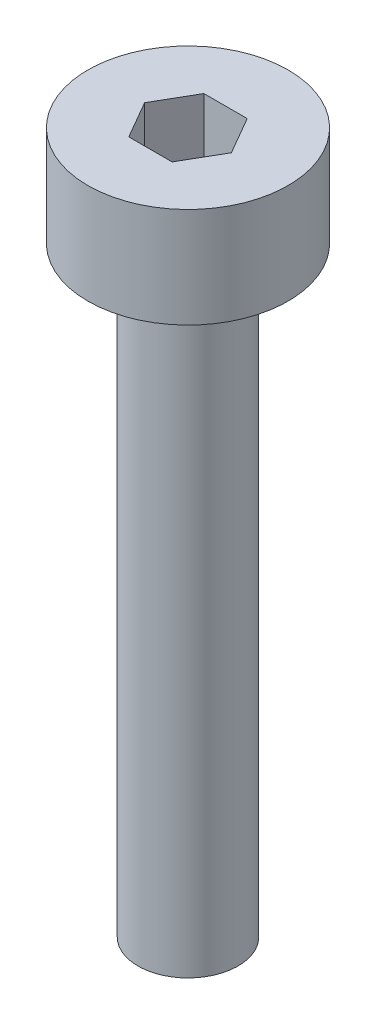
ISO-10303-21;
HEADER;
FILE_DESCRIPTION(('STEP AP214'),'2;1');
FILE_NAME('part.step','',(''),(''),'','','');
FILE_SCHEMA(('AUTOMOTIVE_DESIGN { 1 0 10303 214 1 1 1 1 }'));
ENDSEC;
DATA;
#1=APPLICATION_CONTEXT('core data for automotive mechanical design processes');
#2=APPLICATION_PROTOCOL_DEFINITION('international standard','automotive_design',2000,#1);
#3=PRODUCT_CONTEXT('',#1,'mechanical');
#4=PRODUCT('Part','Part','',(#3));
#5=PRODUCT_RELATED_PRODUCT_CATEGORY('part','',(#4));
#6=PRODUCT_DEFINITION_FORMATION('','',#4);
#7=PRODUCT_DEFINITION_CONTEXT('part definition',#1,'design');
#8=PRODUCT_DEFINITION('design','',#6,#7);
#9=PRODUCT_DEFINITION_SHAPE('','',#8);
#10=(LENGTH_UNIT() NAMED_UNIT(*) SI_UNIT(.MILLI.,.METRE.));
#11=(NAMED_UNIT(*) PLANE_ANGLE_UNIT() SI_UNIT($,.RADIAN.));
#12=(NAMED_UNIT(*) SI_UNIT($,.STERADIAN.) SOLID_ANGLE_UNIT());
#13=UNCERTAINTY_MEASURE_WITH_UNIT(LENGTH_MEASURE(1.E-05),#10,'distance_accuracy_value','');
#14=(GEOMETRIC_REPRESENTATION_CONTEXT(3) GLOBAL_UNCERTAINTY_ASSIGNED_CONTEXT((#13)) GLOBAL_UNIT_ASSIGNED_CONTEXT((#10,
#11,#12)) REPRESENTATION_CONTEXT('',''));
#15=CARTESIAN_POINT('',(0.,0.,0.));
#16=DIRECTION('',(0.,0.,1.));
#17=DIRECTION('',(1.,0.,0.));
#18=AXIS2_PLACEMENT_3D('',#15,#16,#17);
#19=CARTESIAN_POINT('',(0.,2.,0.));
#20=DIRECTION('',(0.,-1.,0.));
#21=DIRECTION('',(0.,0.,-1.));
#22=AXIS2_PLACEMENT_3D('',#19,#20,#21);
#23=CYLINDRICAL_SURFACE('',#22,2.);
#24=CARTESIAN_POINT('',(0.,2.,0.));
#25=DIRECTION('',(0.,1.,0.));
#26=DIRECTION('',(0.,0.,1.));
#27=AXIS2_PLACEMENT_3D('',#24,#25,#26);
#28=CIRCLE('',#27,2.);
#29=CARTESIAN_POINT('',(0.,2.,2.));
#30=VERTEX_POINT('',#29);
#31=EDGE_CURVE('E43',#30,#30,#28,.T.);
#32=ORIENTED_EDGE('',*,*,#31,.F.);
#33=EDGE_LOOP('',(#32));
#34=FACE_BOUND('',#33,.T.);
#35=CARTESIAN_POINT('',(0.,0.,0.));
#36=DIRECTION('',(0.,1.,0.));
#37=DIRECTION('',(0.,0.,1.));
#38=AXIS2_PLACEMENT_3D('',#35,#36,#37);
#39=CIRCLE('',#38,2.);
#40=CARTESIAN_POINT('',(0.,0.,2.));
#41=VERTEX_POINT('',#40);
#42=EDGE_CURVE('E38',#41,#41,#39,.T.);
#43=ORIENTED_EDGE('',*,*,#42,.T.);
#44=EDGE_LOOP('',(#43));
#45=FACE_BOUND('',#44,.T.);
#46=ADVANCED_FACE('F35',(#34,#45),#23,.T.);
#47=CARTESIAN_POINT('',(0.,2.,0.));
#48=DIRECTION('',(0.,1.,0.));
#49=DIRECTION('',(0.,0.,1.));
#50=AXIS2_PLACEMENT_3D('',#47,#48,#49);
#51=PLANE('',#50);
#52=DIRECTION('',(0.5,0.,-0.866025403784439));
#53=VECTOR('',#52,1.);
#54=CARTESIAN_POINT('',(0.433012701892219,2.,0.75));
#55=LINE('',#54,#53);
#56=CARTESIAN_POINT('',(0.433012701892219,2.,0.75));
#57=VERTEX_POINT('',#56);
#58=CARTESIAN_POINT('',(0.866025403784438,2.,0.));
#59=VERTEX_POINT('',#58);
#60=EDGE_CURVE('E51',#57,#59,#55,.T.);
#61=ORIENTED_EDGE('',*,*,#60,.F.);
#62=DIRECTION('',(1.,0.,0.));
#63=VECTOR('',#62,1.);
#64=CARTESIAN_POINT('',(-0.43301270189222,2.,0.75));
#65=LINE('',#64,#63);
#66=CARTESIAN_POINT('',(-0.43301270189222,2.,0.75));
#67=VERTEX_POINT('',#66);
#68=EDGE_CURVE('E135',#67,#57,#65,.T.);
#69=ORIENTED_EDGE('',*,*,#68,.F.);
#70=DIRECTION('',(0.5,0.,0.866025403784439));
#71=VECTOR('',#70,1.);
#72=CARTESIAN_POINT('',(-0.866025403784439,2.,0.));
#73=LINE('',#72,#71);
#74=CARTESIAN_POINT('',(-0.866025403784439,2.,0.));
#75=VERTEX_POINT('',#74);
#76=EDGE_CURVE('E133',#75,#67,#73,.T.);
#77=ORIENTED_EDGE('',*,*,#76,.F.);
#78=DIRECTION('',(-0.5,0.,0.866025403784439));
#79=VECTOR('',#78,1.);
#80=CARTESIAN_POINT('',(-0.43301270189222,2.,-0.750000000000001));
#81=LINE('',#80,#79);
#82=CARTESIAN_POINT('',(-0.43301270189222,2.,-0.750000000000001));
#83=VERTEX_POINT('',#82);
#84=EDGE_CURVE('E99',#83,#75,#81,.T.);
#85=ORIENTED_EDGE('',*,*,#84,.F.);
#86=DIRECTION('',(-1.,0.,0.));
#87=VECTOR('',#86,1.);
#88=CARTESIAN_POINT('',(0.433012701892219,2.,-0.75));
#89=LINE('',#88,#87);
#90=CARTESIAN_POINT('',(0.433012701892219,2.,-0.75));
#91=VERTEX_POINT('',#90);
#92=EDGE_CURVE('E129',#91,#83,#89,.T.);
#93=ORIENTED_EDGE('',*,*,#92,.F.);
#94=DIRECTION('',(-0.5,0.,-0.866025403784439));
#95=VECTOR('',#94,1.);
#96=CARTESIAN_POINT('',(0.866025403784438,2.,0.));
#97=LINE('',#96,#95);
#98=EDGE_CURVE('E125',#59,#91,#97,.T.);
#99=ORIENTED_EDGE('',*,*,#98,.F.);
#100=EDGE_LOOP('',(#61,#69,#77,#85,#93,#99));
#101=FACE_BOUND('',#100,.T.);
#102=ORIENTED_EDGE('',*,*,#31,.T.);
#103=EDGE_LOOP('',(#102));
#104=FACE_BOUND('',#103,.T.);
#105=ADVANCED_FACE('F153',(#101,#104),#51,.T.);
#106=CARTESIAN_POINT('',(0.,0.,0.));
#107=DIRECTION('',(0.,1.,0.));
#108=DIRECTION('',(0.,0.,1.));
#109=AXIS2_PLACEMENT_3D('',#106,#107,#108);
#110=PLANE('',#109);
#111=CARTESIAN_POINT('',(0.,0.,0.));
#112=DIRECTION('',(0.,-1.,0.));
#113=DIRECTION('',(0.,0.,-1.));
#114=AXIS2_PLACEMENT_3D('',#111,#112,#113);
#115=CIRCLE('',#114,1.);
#116=CARTESIAN_POINT('',(0.,0.,-1.));
#117=VERTEX_POINT('',#116);
#118=EDGE_CURVE('E11',#117,#117,#115,.T.);
#119=ORIENTED_EDGE('',*,*,#118,.F.);
#120=EDGE_LOOP('',(#119));
#121=FACE_BOUND('',#120,.T.);
#122=ORIENTED_EDGE('',*,*,#42,.F.);
#123=EDGE_LOOP('',(#122));
#124=FACE_BOUND('',#123,.T.);
#125=ADVANCED_FACE('F150',(#121,#124),#110,.F.);
#126=CARTESIAN_POINT('',(0.433012701892219,0.5,0.75));
#127=DIRECTION('',(0.866025403784439,0.,0.5));
#128=DIRECTION('',(0.5,0.,-0.866025403784439));
#129=AXIS2_PLACEMENT_3D('',#126,#127,#128);
#130=PLANE('',#129);
#131=ORIENTED_EDGE('',*,*,#60,.T.);
#132=DIRECTION('',(0.,1.,0.));
#133=VECTOR('',#132,1.);
#134=CARTESIAN_POINT('',(0.866025403784438,0.5,0.));
#135=LINE('',#134,#133);
#136=CARTESIAN_POINT('',(0.866025403784438,0.5,0.));
#137=VERTEX_POINT('',#136);
#138=EDGE_CURVE('E81',#137,#59,#135,.T.);
#139=ORIENTED_EDGE('',*,*,#138,.F.);
#140=DIRECTION('',(0.5,0.,-0.866025403784439));
#141=VECTOR('',#140,1.);
#142=CARTESIAN_POINT('',(0.433012701892219,0.5,0.75));
#143=LINE('',#142,#141);
#144=CARTESIAN_POINT('',(0.433012701892219,0.5,0.75));
#145=VERTEX_POINT('',#144);
#146=EDGE_CURVE('E137',#145,#137,#143,.T.);
#147=ORIENTED_EDGE('',*,*,#146,.F.);
#148=DIRECTION('',(0.,1.,0.));
#149=VECTOR('',#148,1.);
#150=CARTESIAN_POINT('',(0.433012701892219,0.5,0.75));
#151=LINE('',#150,#149);
#152=EDGE_CURVE('E59',#145,#57,#151,.T.);
#153=ORIENTED_EDGE('',*,*,#152,.T.);
#154=EDGE_LOOP('',(#131,#139,#147,#153));
#155=FACE_BOUND('',#154,.T.);
#156=ADVANCED_FACE('F152',(#155),#130,.F.);
#157=CARTESIAN_POINT('',(-0.43301270189222,0.5,0.75));
#158=DIRECTION('',(0.,0.,1.));
#159=DIRECTION('',(1.,0.,0.));
#160=AXIS2_PLACEMENT_3D('',#157,#158,#159);
#161=PLANE('',#160);
#162=ORIENTED_EDGE('',*,*,#68,.T.);
#163=ORIENTED_EDGE('',*,*,#152,.F.);
#164=DIRECTION('',(1.,0.,0.));
#165=VECTOR('',#164,1.);
#166=CARTESIAN_POINT('',(-0.43301270189222,0.5,0.75));
#167=LINE('',#166,#165);
#168=CARTESIAN_POINT('',(-0.43301270189222,0.5,0.75));
#169=VERTEX_POINT('',#168);
#170=EDGE_CURVE('E111',#169,#145,#167,.T.);
#171=ORIENTED_EDGE('',*,*,#170,.F.);
#172=DIRECTION('',(0.,1.,0.));
#173=VECTOR('',#172,1.);
#174=CARTESIAN_POINT('',(-0.43301270189222,0.5,0.75));
#175=LINE('',#174,#173);
#176=EDGE_CURVE('E103',#169,#67,#175,.T.);
#177=ORIENTED_EDGE('',*,*,#176,.T.);
#178=EDGE_LOOP('',(#162,#163,#171,#177));
#179=FACE_BOUND('',#178,.T.);
#180=ADVANCED_FACE('F159',(#179),#161,.F.);
#181=CARTESIAN_POINT('',(-0.866025403784439,0.5,0.));
#182=DIRECTION('',(-0.866025403784439,0.,0.5));
#183=DIRECTION('',(0.5,0.,0.866025403784439));
#184=AXIS2_PLACEMENT_3D('',#181,#182,#183);
#185=PLANE('',#184);
#186=ORIENTED_EDGE('',*,*,#76,.T.);
#187=ORIENTED_EDGE('',*,*,#176,.F.);
#188=DIRECTION('',(0.5,0.,0.866025403784439));
#189=VECTOR('',#188,1.);
#190=CARTESIAN_POINT('',(-0.866025403784439,0.5,0.));
#191=LINE('',#190,#189);
#192=CARTESIAN_POINT('',(-0.866025403784439,0.5,0.));
#193=VERTEX_POINT('',#192);
#194=EDGE_CURVE('E107',#193,#169,#191,.T.);
#195=ORIENTED_EDGE('',*,*,#194,.F.);
#196=DIRECTION('',(0.,1.,0.));
#197=VECTOR('',#196,1.);
#198=CARTESIAN_POINT('',(-0.866025403784439,0.5,0.));
#199=LINE('',#198,#197);
#200=EDGE_CURVE('E92',#193,#75,#199,.T.);
#201=ORIENTED_EDGE('',*,*,#200,.T.);
#202=EDGE_LOOP('',(#186,#187,#195,#201));
#203=FACE_BOUND('',#202,.T.);
#204=ADVANCED_FACE('F108',(#203),#185,.F.);
#205=CARTESIAN_POINT('',(-0.43301270189222,0.5,-0.750000000000001));
#206=DIRECTION('',(-0.866025403784439,0.,-0.5));
#207=DIRECTION('',(-0.5,0.,0.866025403784439));
#208=AXIS2_PLACEMENT_3D('',#205,#206,#207);
#209=PLANE('',#208);
#210=ORIENTED_EDGE('',*,*,#84,.T.);
#211=ORIENTED_EDGE('',*,*,#200,.F.);
#212=DIRECTION('',(-0.5,0.,0.866025403784439));
#213=VECTOR('',#212,1.);
#214=CARTESIAN_POINT('',(-0.43301270189222,0.5,-0.750000000000001));
#215=LINE('',#214,#213);
#216=CARTESIAN_POINT('',(-0.43301270189222,0.5,-0.750000000000001));
#217=VERTEX_POINT('',#216);
#218=EDGE_CURVE('E96',#217,#193,#215,.T.);
#219=ORIENTED_EDGE('',*,*,#218,.F.);
#220=DIRECTION('',(0.,1.,0.));
#221=VECTOR('',#220,1.);
#222=CARTESIAN_POINT('',(-0.43301270189222,0.5,-0.750000000000001));
#223=LINE('',#222,#221);
#224=EDGE_CURVE('E104',#217,#83,#223,.T.);
#225=ORIENTED_EDGE('',*,*,#224,.T.);
#226=EDGE_LOOP('',(#210,#211,#219,#225));
#227=FACE_BOUND('',#226,.T.);
#228=ADVANCED_FACE('F94',(#227),#209,.F.);
#229=CARTESIAN_POINT('',(0.433012701892219,0.5,-0.75));
#230=DIRECTION('',(0.,0.,-1.));
#231=DIRECTION('',(-1.,0.,0.));
#232=AXIS2_PLACEMENT_3D('',#229,#230,#231);
#233=PLANE('',#232);
#234=ORIENTED_EDGE('',*,*,#92,.T.);
#235=ORIENTED_EDGE('',*,*,#224,.F.);
#236=DIRECTION('',(-1.,0.,0.));
#237=VECTOR('',#236,1.);
#238=CARTESIAN_POINT('',(0.433012701892219,0.5,-0.75));
#239=LINE('',#238,#237);
#240=CARTESIAN_POINT('',(0.433012701892219,0.5,-0.75));
#241=VERTEX_POINT('',#240);
#242=EDGE_CURVE('E117',#241,#217,#239,.T.);
#243=ORIENTED_EDGE('',*,*,#242,.F.);
#244=DIRECTION('',(0.,1.,0.));
#245=VECTOR('',#244,1.);
#246=CARTESIAN_POINT('',(0.433012701892219,0.5,-0.75));
#247=LINE('',#246,#245);
#248=EDGE_CURVE('E141',#241,#91,#247,.T.);
#249=ORIENTED_EDGE('',*,*,#248,.T.);
#250=EDGE_LOOP('',(#234,#235,#243,#249));
#251=FACE_BOUND('',#250,.T.);
#252=ADVANCED_FACE('F204',(#251),#233,.F.);
#253=CARTESIAN_POINT('',(0.866025403784438,0.5,0.));
#254=DIRECTION('',(0.866025403784438,0.,-0.5));
#255=DIRECTION('',(-0.5,0.,-0.866025403784439));
#256=AXIS2_PLACEMENT_3D('',#253,#254,#255);
#257=PLANE('',#256);
#258=ORIENTED_EDGE('',*,*,#98,.T.);
#259=ORIENTED_EDGE('',*,*,#248,.F.);
#260=DIRECTION('',(-0.5,0.,-0.866025403784439));
#261=VECTOR('',#260,1.);
#262=CARTESIAN_POINT('',(0.866025403784438,0.5,0.));
#263=LINE('',#262,#261);
#264=EDGE_CURVE('E119',#137,#241,#263,.T.);
#265=ORIENTED_EDGE('',*,*,#264,.F.);
#266=ORIENTED_EDGE('',*,*,#138,.T.);
#267=EDGE_LOOP('',(#258,#259,#265,#266));
#268=FACE_BOUND('',#267,.T.);
#269=ADVANCED_FACE('F213',(#268),#257,.F.);
#270=CARTESIAN_POINT('',(0.,0.5,0.));
#271=DIRECTION('',(0.,1.,0.));
#272=DIRECTION('',(0.,0.,1.));
#273=AXIS2_PLACEMENT_3D('',#270,#271,#272);
#274=PLANE('',#273);
#275=ORIENTED_EDGE('',*,*,#146,.T.);
#276=ORIENTED_EDGE('',*,*,#264,.T.);
#277=ORIENTED_EDGE('',*,*,#242,.T.);
#278=ORIENTED_EDGE('',*,*,#218,.T.);
#279=ORIENTED_EDGE('',*,*,#194,.T.);
#280=ORIENTED_EDGE('',*,*,#170,.T.);
#281=EDGE_LOOP('',(#275,#276,#277,#278,#279,#280));
#282=FACE_BOUND('',#281,.T.);
#283=ADVANCED_FACE('F114',(#282),#274,.T.);
#284=CARTESIAN_POINT('',(0.,-12.,0.));
#285=DIRECTION('',(0.,1.,0.));
#286=DIRECTION('',(0.,0.,1.));
#287=AXIS2_PLACEMENT_3D('',#284,#285,#286);
#288=CYLINDRICAL_SURFACE('',#287,1.);
#289=CARTESIAN_POINT('',(0.,-12.,0.));
#290=DIRECTION('',(0.,-1.,0.));
#291=DIRECTION('',(0.,0.,-1.));
#292=AXIS2_PLACEMENT_3D('',#289,#290,#291);
#293=CIRCLE('',#292,1.);
#294=CARTESIAN_POINT('',(0.,-12.,-1.));
#295=VERTEX_POINT('',#294);
#296=EDGE_CURVE('E126',#295,#295,#293,.T.);
#297=ORIENTED_EDGE('',*,*,#296,.F.);
#298=EDGE_LOOP('',(#297));
#299=FACE_BOUND('',#298,.T.);
#300=ORIENTED_EDGE('',*,*,#118,.T.);
#301=EDGE_LOOP('',(#300));
#302=FACE_BOUND('',#301,.T.);
#303=ADVANCED_FACE('F231',(#299,#302),#288,.T.);
#304=CARTESIAN_POINT('',(0.,-12.,0.));
#305=DIRECTION('',(0.,-1.,0.));
#306=DIRECTION('',(0.,0.,-1.));
#307=AXIS2_PLACEMENT_3D('',#304,#305,#306);
#308=PLANE('',#307);
#309=ORIENTED_EDGE('',*,*,#296,.T.);
#310=EDGE_LOOP('',(#309));
#311=FACE_BOUND('',#310,.T.);
#312=ADVANCED_FACE('F244',(#311),#308,.T.);
#313=CLOSED_SHELL('',(#46,#105,#125,#156,#180,#204,#228,#252,#269,#283,#303,#312));
#314=MANIFOLD_SOLID_BREP('B2',#313);
#315=ADVANCED_BREP_SHAPE_REPRESENTATION('',(#18,#314),#14);
#316=SHAPE_DEFINITION_REPRESENTATION(#9,#315);
ENDSEC;
END-ISO-10303-21;
